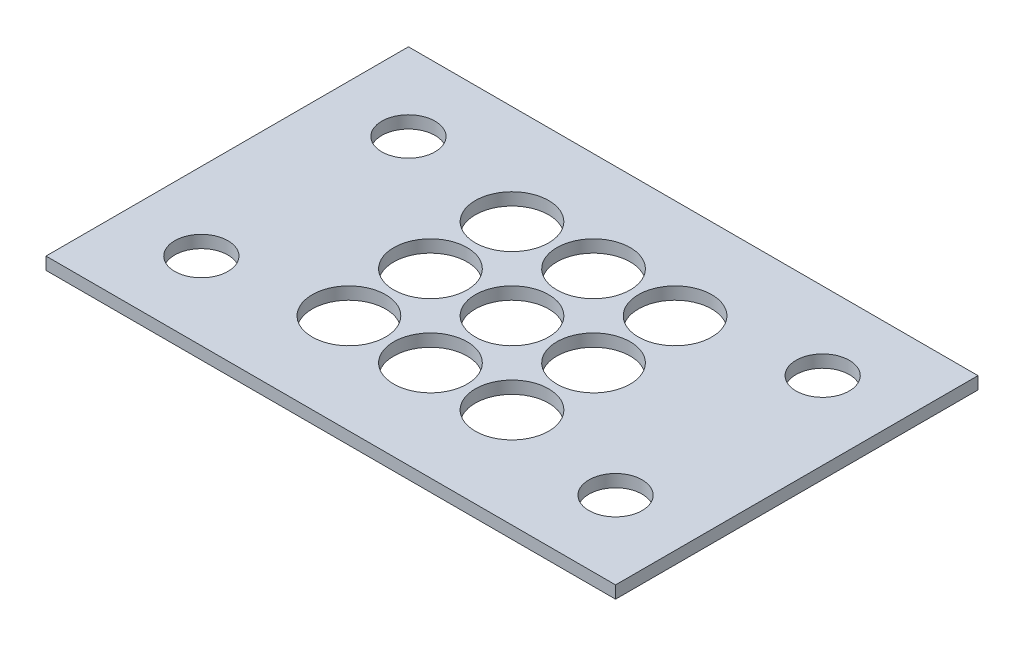
ISO-10303-21;
HEADER;
FILE_DESCRIPTION(('STEP AP214'),'2;1');
FILE_NAME('part.step','',(''),(''),'','','');
FILE_SCHEMA(('AUTOMOTIVE_DESIGN { 1 0 10303 214 1 1 1 1 }'));
ENDSEC;
DATA;
#1=APPLICATION_CONTEXT('core data for automotive mechanical design processes');
#2=APPLICATION_PROTOCOL_DEFINITION('international standard','automotive_design',2000,#1);
#3=PRODUCT_CONTEXT('',#1,'mechanical');
#4=PRODUCT('Part','Part','',(#3));
#5=PRODUCT_RELATED_PRODUCT_CATEGORY('part','',(#4));
#6=PRODUCT_DEFINITION_FORMATION('','',#4);
#7=PRODUCT_DEFINITION_CONTEXT('part definition',#1,'design');
#8=PRODUCT_DEFINITION('design','',#6,#7);
#9=PRODUCT_DEFINITION_SHAPE('','',#8);
#10=(LENGTH_UNIT() NAMED_UNIT(*) SI_UNIT(.MILLI.,.METRE.));
#11=(NAMED_UNIT(*) PLANE_ANGLE_UNIT() SI_UNIT($,.RADIAN.));
#12=(NAMED_UNIT(*) SI_UNIT($,.STERADIAN.) SOLID_ANGLE_UNIT());
#13=UNCERTAINTY_MEASURE_WITH_UNIT(LENGTH_MEASURE(1.E-05),#10,'distance_accuracy_value','');
#14=(GEOMETRIC_REPRESENTATION_CONTEXT(3) GLOBAL_UNCERTAINTY_ASSIGNED_CONTEXT((#13)) GLOBAL_UNIT_ASSIGNED_CONTEXT((#10,
#11,#12)) REPRESENTATION_CONTEXT('',''));
#15=CARTESIAN_POINT('',(0.,0.,0.));
#16=DIRECTION('',(0.,0.,1.));
#17=DIRECTION('',(1.,0.,0.));
#18=AXIS2_PLACEMENT_3D('',#15,#16,#17);
#19=CARTESIAN_POINT('',(0.,1.524,0.));
#20=DIRECTION('',(0.,0.,-1.));
#21=DIRECTION('',(-1.,0.,0.));
#22=AXIS2_PLACEMENT_3D('',#19,#20,#21);
#23=PLANE('',#22);
#24=DIRECTION('',(1.,0.,0.));
#25=VECTOR('',#24,1.);
#26=CARTESIAN_POINT('',(0.,0.,0.));
#27=LINE('',#26,#25);
#28=CARTESIAN_POINT('',(0.,0.,0.));
#29=VERTEX_POINT('',#28);
#30=CARTESIAN_POINT('',(69.85,0.,0.));
#31=VERTEX_POINT('',#30);
#32=EDGE_CURVE('E168',#29,#31,#27,.T.);
#33=ORIENTED_EDGE('',*,*,#32,.T.);
#34=DIRECTION('',(0.,-1.,0.));
#35=VECTOR('',#34,1.);
#36=CARTESIAN_POINT('',(69.85,1.524,0.));
#37=LINE('',#36,#35);
#38=CARTESIAN_POINT('',(69.85,1.524,0.));
#39=VERTEX_POINT('',#38);
#40=EDGE_CURVE('E11',#39,#31,#37,.T.);
#41=ORIENTED_EDGE('',*,*,#40,.F.);
#42=DIRECTION('',(1.,0.,0.));
#43=VECTOR('',#42,1.);
#44=CARTESIAN_POINT('',(0.,1.524,0.));
#45=LINE('',#44,#43);
#46=CARTESIAN_POINT('',(0.,1.524,0.));
#47=VERTEX_POINT('',#46);
#48=EDGE_CURVE('E98',#47,#39,#45,.T.);
#49=ORIENTED_EDGE('',*,*,#48,.F.);
#50=DIRECTION('',(0.,-1.,0.));
#51=VECTOR('',#50,1.);
#52=CARTESIAN_POINT('',(0.,1.524,0.));
#53=LINE('',#52,#51);
#54=EDGE_CURVE('E65',#47,#29,#53,.T.);
#55=ORIENTED_EDGE('',*,*,#54,.T.);
#56=EDGE_LOOP('',(#33,#41,#49,#55));
#57=FACE_BOUND('',#56,.T.);
#58=ADVANCED_FACE('F47',(#57),#23,.F.);
#59=CARTESIAN_POINT('',(69.85,1.524,0.));
#60=DIRECTION('',(-1.,0.,0.));
#61=DIRECTION('',(0.,0.,1.));
#62=AXIS2_PLACEMENT_3D('',#59,#60,#61);
#63=PLANE('',#62);
#64=DIRECTION('',(0.,0.,-1.));
#65=VECTOR('',#64,1.);
#66=CARTESIAN_POINT('',(69.85,0.,0.));
#67=LINE('',#66,#65);
#68=CARTESIAN_POINT('',(69.85,0.,-44.45));
#69=VERTEX_POINT('',#68);
#70=EDGE_CURVE('E104',#31,#69,#67,.T.);
#71=ORIENTED_EDGE('',*,*,#70,.T.);
#72=DIRECTION('',(0.,-1.,0.));
#73=VECTOR('',#72,1.);
#74=CARTESIAN_POINT('',(69.85,1.524,-44.45));
#75=LINE('',#74,#73);
#76=CARTESIAN_POINT('',(69.85,1.524,-44.45));
#77=VERTEX_POINT('',#76);
#78=EDGE_CURVE('E57',#77,#69,#75,.T.);
#79=ORIENTED_EDGE('',*,*,#78,.F.);
#80=DIRECTION('',(0.,0.,-1.));
#81=VECTOR('',#80,1.);
#82=CARTESIAN_POINT('',(69.85,1.524,0.));
#83=LINE('',#82,#81);
#84=EDGE_CURVE('E90',#39,#77,#83,.T.);
#85=ORIENTED_EDGE('',*,*,#84,.F.);
#86=ORIENTED_EDGE('',*,*,#40,.T.);
#87=EDGE_LOOP('',(#71,#79,#85,#86));
#88=FACE_BOUND('',#87,.T.);
#89=ADVANCED_FACE('F103',(#88),#63,.F.);
#90=CARTESIAN_POINT('',(0.,1.524,-44.45));
#91=DIRECTION('',(0.,0.,-1.));
#92=DIRECTION('',(-1.,0.,0.));
#93=AXIS2_PLACEMENT_3D('',#90,#91,#92);
#94=PLANE('',#93);
#95=DIRECTION('',(1.,0.,0.));
#96=VECTOR('',#95,1.);
#97=CARTESIAN_POINT('',(0.,0.,-44.45));
#98=LINE('',#97,#96);
#99=CARTESIAN_POINT('',(0.,0.,-44.45));
#100=VERTEX_POINT('',#99);
#101=EDGE_CURVE('E173',#100,#69,#98,.T.);
#102=ORIENTED_EDGE('',*,*,#101,.F.);
#103=DIRECTION('',(0.,-1.,0.));
#104=VECTOR('',#103,1.);
#105=CARTESIAN_POINT('',(0.,1.524,-44.45));
#106=LINE('',#105,#104);
#107=CARTESIAN_POINT('',(0.,1.524,-44.45));
#108=VERTEX_POINT('',#107);
#109=EDGE_CURVE('E79',#108,#100,#106,.T.);
#110=ORIENTED_EDGE('',*,*,#109,.F.);
#111=DIRECTION('',(1.,0.,0.));
#112=VECTOR('',#111,1.);
#113=CARTESIAN_POINT('',(0.,1.524,-44.45));
#114=LINE('',#113,#112);
#115=EDGE_CURVE('E97',#108,#77,#114,.T.);
#116=ORIENTED_EDGE('',*,*,#115,.T.);
#117=ORIENTED_EDGE('',*,*,#78,.T.);
#118=EDGE_LOOP('',(#102,#110,#116,#117));
#119=FACE_BOUND('',#118,.T.);
#120=ADVANCED_FACE('F108',(#119),#94,.T.);
#121=CARTESIAN_POINT('',(9.525,1.524,-34.925));
#122=DIRECTION('',(0.,-1.,0.));
#123=DIRECTION('',(0.,0.,-1.));
#124=AXIS2_PLACEMENT_3D('',#121,#122,#123);
#125=CYLINDRICAL_SURFACE('',#124,3.2639);
#126=CARTESIAN_POINT('',(9.525,1.524,-34.925));
#127=DIRECTION('',(0.,1.,0.));
#128=DIRECTION('',(0.,0.,1.));
#129=AXIS2_PLACEMENT_3D('',#126,#127,#128);
#130=CIRCLE('',#129,3.2639);
#131=CARTESIAN_POINT('',(9.525,1.524,-31.6611));
#132=VERTEX_POINT('',#131);
#133=EDGE_CURVE('E235',#132,#132,#130,.T.);
#134=ORIENTED_EDGE('',*,*,#133,.T.);
#135=EDGE_LOOP('',(#134));
#136=FACE_BOUND('',#135,.T.);
#137=CARTESIAN_POINT('',(9.525,0.,-34.925));
#138=DIRECTION('',(0.,1.,0.));
#139=DIRECTION('',(0.,0.,1.));
#140=AXIS2_PLACEMENT_3D('',#137,#138,#139);
#141=CIRCLE('',#140,3.2639);
#142=CARTESIAN_POINT('',(9.525,0.,-31.6611));
#143=VERTEX_POINT('',#142);
#144=EDGE_CURVE('E164',#143,#143,#141,.T.);
#145=ORIENTED_EDGE('',*,*,#144,.F.);
#146=EDGE_LOOP('',(#145));
#147=FACE_BOUND('',#146,.T.);
#148=ADVANCED_FACE('F241',(#136,#147),#125,.F.);
#149=CARTESIAN_POINT('',(60.325,1.524,-34.925));
#150=DIRECTION('',(0.,-1.,0.));
#151=DIRECTION('',(0.,0.,-1.));
#152=AXIS2_PLACEMENT_3D('',#149,#150,#151);
#153=CYLINDRICAL_SURFACE('',#152,3.2639);
#154=CARTESIAN_POINT('',(60.325,1.524,-34.925));
#155=DIRECTION('',(0.,1.,0.));
#156=DIRECTION('',(0.,0.,1.));
#157=AXIS2_PLACEMENT_3D('',#154,#155,#156);
#158=CIRCLE('',#157,3.2639);
#159=CARTESIAN_POINT('',(60.325,1.524,-31.6611));
#160=VERTEX_POINT('',#159);
#161=EDGE_CURVE('E231',#160,#160,#158,.T.);
#162=ORIENTED_EDGE('',*,*,#161,.T.);
#163=EDGE_LOOP('',(#162));
#164=FACE_BOUND('',#163,.T.);
#165=CARTESIAN_POINT('',(60.325,0.,-34.925));
#166=DIRECTION('',(0.,1.,0.));
#167=DIRECTION('',(0.,0.,1.));
#168=AXIS2_PLACEMENT_3D('',#165,#166,#167);
#169=CIRCLE('',#168,3.2639);
#170=CARTESIAN_POINT('',(60.325,0.,-31.6611));
#171=VERTEX_POINT('',#170);
#172=EDGE_CURVE('E160',#171,#171,#169,.T.);
#173=ORIENTED_EDGE('',*,*,#172,.F.);
#174=EDGE_LOOP('',(#173));
#175=FACE_BOUND('',#174,.T.);
#176=ADVANCED_FACE('F267',(#164,#175),#153,.F.);
#177=CARTESIAN_POINT('',(9.52500000000001,1.524,-9.525));
#178=DIRECTION('',(0.,-1.,0.));
#179=DIRECTION('',(0.,0.,-1.));
#180=AXIS2_PLACEMENT_3D('',#177,#178,#179);
#181=CYLINDRICAL_SURFACE('',#180,3.2639);
#182=CARTESIAN_POINT('',(9.52500000000001,1.524,-9.525));
#183=DIRECTION('',(0.,1.,0.));
#184=DIRECTION('',(0.,0.,1.));
#185=AXIS2_PLACEMENT_3D('',#182,#183,#184);
#186=CIRCLE('',#185,3.2639);
#187=CARTESIAN_POINT('',(9.52500000000001,1.524,-6.2611));
#188=VERTEX_POINT('',#187);
#189=EDGE_CURVE('E227',#188,#188,#186,.T.);
#190=ORIENTED_EDGE('',*,*,#189,.T.);
#191=EDGE_LOOP('',(#190));
#192=FACE_BOUND('',#191,.T.);
#193=CARTESIAN_POINT('',(9.52500000000001,0.,-9.525));
#194=DIRECTION('',(0.,1.,0.));
#195=DIRECTION('',(0.,0.,1.));
#196=AXIS2_PLACEMENT_3D('',#193,#194,#195);
#197=CIRCLE('',#196,3.2639);
#198=CARTESIAN_POINT('',(9.52500000000001,0.,-6.2611));
#199=VERTEX_POINT('',#198);
#200=EDGE_CURVE('E156',#199,#199,#197,.T.);
#201=ORIENTED_EDGE('',*,*,#200,.F.);
#202=EDGE_LOOP('',(#201));
#203=FACE_BOUND('',#202,.T.);
#204=ADVANCED_FACE('F270',(#192,#203),#181,.F.);
#205=CARTESIAN_POINT('',(60.325,1.524,-9.525));
#206=DIRECTION('',(0.,-1.,0.));
#207=DIRECTION('',(0.,0.,-1.));
#208=AXIS2_PLACEMENT_3D('',#205,#206,#207);
#209=CYLINDRICAL_SURFACE('',#208,3.26389999999999);
#210=CARTESIAN_POINT('',(60.325,1.524,-9.525));
#211=DIRECTION('',(0.,1.,0.));
#212=DIRECTION('',(0.,0.,1.));
#213=AXIS2_PLACEMENT_3D('',#210,#211,#212);
#214=CIRCLE('',#213,3.26389999999999);
#215=CARTESIAN_POINT('',(60.325,1.524,-6.2611));
#216=VERTEX_POINT('',#215);
#217=EDGE_CURVE('E223',#216,#216,#214,.T.);
#218=ORIENTED_EDGE('',*,*,#217,.T.);
#219=EDGE_LOOP('',(#218));
#220=FACE_BOUND('',#219,.T.);
#221=CARTESIAN_POINT('',(60.325,0.,-9.525));
#222=DIRECTION('',(0.,1.,0.));
#223=DIRECTION('',(0.,0.,1.));
#224=AXIS2_PLACEMENT_3D('',#221,#222,#223);
#225=CIRCLE('',#224,3.26389999999999);
#226=CARTESIAN_POINT('',(60.325,0.,-6.2611));
#227=VERTEX_POINT('',#226);
#228=EDGE_CURVE('E152',#227,#227,#225,.T.);
#229=ORIENTED_EDGE('',*,*,#228,.F.);
#230=EDGE_LOOP('',(#229));
#231=FACE_BOUND('',#230,.T.);
#232=ADVANCED_FACE('F274',(#220,#231),#209,.F.);
#233=CARTESIAN_POINT('',(34.925,1.524,-22.225));
#234=DIRECTION('',(0.,-1.,0.));
#235=DIRECTION('',(0.,0.,-1.));
#236=AXIS2_PLACEMENT_3D('',#233,#234,#235);
#237=CYLINDRICAL_SURFACE('',#236,4.5);
#238=CARTESIAN_POINT('',(34.925,1.524,-22.225));
#239=DIRECTION('',(0.,1.,0.));
#240=DIRECTION('',(0.,0.,1.));
#241=AXIS2_PLACEMENT_3D('',#238,#239,#240);
#242=CIRCLE('',#241,4.5);
#243=CARTESIAN_POINT('',(34.925,1.524,-17.725));
#244=VERTEX_POINT('',#243);
#245=EDGE_CURVE('E219',#244,#244,#242,.T.);
#246=ORIENTED_EDGE('',*,*,#245,.T.);
#247=EDGE_LOOP('',(#246));
#248=FACE_BOUND('',#247,.T.);
#249=CARTESIAN_POINT('',(34.925,0.,-22.225));
#250=DIRECTION('',(0.,1.,0.));
#251=DIRECTION('',(0.,0.,1.));
#252=AXIS2_PLACEMENT_3D('',#249,#250,#251);
#253=CIRCLE('',#252,4.5);
#254=CARTESIAN_POINT('',(34.925,0.,-17.725));
#255=VERTEX_POINT('',#254);
#256=EDGE_CURVE('E148',#255,#255,#253,.T.);
#257=ORIENTED_EDGE('',*,*,#256,.F.);
#258=EDGE_LOOP('',(#257));
#259=FACE_BOUND('',#258,.T.);
#260=ADVANCED_FACE('F278',(#248,#259),#237,.F.);
#261=CARTESIAN_POINT('',(44.925,1.524,-22.225));
#262=DIRECTION('',(0.,-1.,0.));
#263=DIRECTION('',(0.,0.,-1.));
#264=AXIS2_PLACEMENT_3D('',#261,#262,#263);
#265=CYLINDRICAL_SURFACE('',#264,4.5);
#266=CARTESIAN_POINT('',(44.925,1.524,-22.225));
#267=DIRECTION('',(0.,1.,0.));
#268=DIRECTION('',(0.,0.,1.));
#269=AXIS2_PLACEMENT_3D('',#266,#267,#268);
#270=CIRCLE('',#269,4.5);
#271=CARTESIAN_POINT('',(44.925,1.524,-17.725));
#272=VERTEX_POINT('',#271);
#273=EDGE_CURVE('E215',#272,#272,#270,.T.);
#274=ORIENTED_EDGE('',*,*,#273,.T.);
#275=EDGE_LOOP('',(#274));
#276=FACE_BOUND('',#275,.T.);
#277=CARTESIAN_POINT('',(44.925,0.,-22.225));
#278=DIRECTION('',(0.,1.,0.));
#279=DIRECTION('',(0.,0.,1.));
#280=AXIS2_PLACEMENT_3D('',#277,#278,#279);
#281=CIRCLE('',#280,4.5);
#282=CARTESIAN_POINT('',(44.925,0.,-17.725));
#283=VERTEX_POINT('',#282);
#284=EDGE_CURVE('E144',#283,#283,#281,.T.);
#285=ORIENTED_EDGE('',*,*,#284,.F.);
#286=EDGE_LOOP('',(#285));
#287=FACE_BOUND('',#286,.T.);
#288=ADVANCED_FACE('F282',(#276,#287),#265,.F.);
#289=CARTESIAN_POINT('',(44.925,1.524,-32.225));
#290=DIRECTION('',(0.,-1.,0.));
#291=DIRECTION('',(0.,0.,-1.));
#292=AXIS2_PLACEMENT_3D('',#289,#290,#291);
#293=CYLINDRICAL_SURFACE('',#292,4.5);
#294=CARTESIAN_POINT('',(44.925,1.524,-32.225));
#295=DIRECTION('',(0.,1.,0.));
#296=DIRECTION('',(0.,0.,1.));
#297=AXIS2_PLACEMENT_3D('',#294,#295,#296);
#298=CIRCLE('',#297,4.5);
#299=CARTESIAN_POINT('',(44.925,1.524,-27.725));
#300=VERTEX_POINT('',#299);
#301=EDGE_CURVE('E211',#300,#300,#298,.T.);
#302=ORIENTED_EDGE('',*,*,#301,.T.);
#303=EDGE_LOOP('',(#302));
#304=FACE_BOUND('',#303,.T.);
#305=CARTESIAN_POINT('',(44.925,0.,-32.225));
#306=DIRECTION('',(0.,1.,0.));
#307=DIRECTION('',(0.,0.,1.));
#308=AXIS2_PLACEMENT_3D('',#305,#306,#307);
#309=CIRCLE('',#308,4.5);
#310=CARTESIAN_POINT('',(44.925,0.,-27.725));
#311=VERTEX_POINT('',#310);
#312=EDGE_CURVE('E140',#311,#311,#309,.T.);
#313=ORIENTED_EDGE('',*,*,#312,.F.);
#314=EDGE_LOOP('',(#313));
#315=FACE_BOUND('',#314,.T.);
#316=ADVANCED_FACE('F286',(#304,#315),#293,.F.);
#317=CARTESIAN_POINT('',(34.925,1.524,-32.225));
#318=DIRECTION('',(0.,-1.,0.));
#319=DIRECTION('',(0.,0.,-1.));
#320=AXIS2_PLACEMENT_3D('',#317,#318,#319);
#321=CYLINDRICAL_SURFACE('',#320,4.5);
#322=CARTESIAN_POINT('',(34.925,1.524,-32.225));
#323=DIRECTION('',(0.,1.,0.));
#324=DIRECTION('',(0.,0.,1.));
#325=AXIS2_PLACEMENT_3D('',#322,#323,#324);
#326=CIRCLE('',#325,4.5);
#327=CARTESIAN_POINT('',(34.925,1.524,-27.725));
#328=VERTEX_POINT('',#327);
#329=EDGE_CURVE('E207',#328,#328,#326,.T.);
#330=ORIENTED_EDGE('',*,*,#329,.T.);
#331=EDGE_LOOP('',(#330));
#332=FACE_BOUND('',#331,.T.);
#333=CARTESIAN_POINT('',(34.925,0.,-32.225));
#334=DIRECTION('',(0.,1.,0.));
#335=DIRECTION('',(0.,0.,1.));
#336=AXIS2_PLACEMENT_3D('',#333,#334,#335);
#337=CIRCLE('',#336,4.5);
#338=CARTESIAN_POINT('',(34.925,0.,-27.725));
#339=VERTEX_POINT('',#338);
#340=EDGE_CURVE('E136',#339,#339,#337,.T.);
#341=ORIENTED_EDGE('',*,*,#340,.F.);
#342=EDGE_LOOP('',(#341));
#343=FACE_BOUND('',#342,.T.);
#344=ADVANCED_FACE('F290',(#332,#343),#321,.F.);
#345=CARTESIAN_POINT('',(44.9250000000001,1.524,-12.225));
#346=DIRECTION('',(0.,-1.,0.));
#347=DIRECTION('',(0.,0.,-1.));
#348=AXIS2_PLACEMENT_3D('',#345,#346,#347);
#349=CYLINDRICAL_SURFACE('',#348,4.5);
#350=CARTESIAN_POINT('',(44.9250000000001,1.524,-12.225));
#351=DIRECTION('',(0.,1.,0.));
#352=DIRECTION('',(0.,0.,1.));
#353=AXIS2_PLACEMENT_3D('',#350,#351,#352);
#354=CIRCLE('',#353,4.5);
#355=CARTESIAN_POINT('',(44.9250000000001,1.524,-7.725));
#356=VERTEX_POINT('',#355);
#357=EDGE_CURVE('E203',#356,#356,#354,.T.);
#358=ORIENTED_EDGE('',*,*,#357,.T.);
#359=EDGE_LOOP('',(#358));
#360=FACE_BOUND('',#359,.T.);
#361=CARTESIAN_POINT('',(44.9250000000001,0.,-12.225));
#362=DIRECTION('',(0.,1.,0.));
#363=DIRECTION('',(0.,0.,1.));
#364=AXIS2_PLACEMENT_3D('',#361,#362,#363);
#365=CIRCLE('',#364,4.5);
#366=CARTESIAN_POINT('',(44.9250000000001,0.,-7.725));
#367=VERTEX_POINT('',#366);
#368=EDGE_CURVE('E132',#367,#367,#365,.T.);
#369=ORIENTED_EDGE('',*,*,#368,.F.);
#370=EDGE_LOOP('',(#369));
#371=FACE_BOUND('',#370,.T.);
#372=ADVANCED_FACE('F294',(#360,#371),#349,.F.);
#373=CARTESIAN_POINT('',(34.9250000000001,1.524,-12.225));
#374=DIRECTION('',(0.,-1.,0.));
#375=DIRECTION('',(0.,0.,-1.));
#376=AXIS2_PLACEMENT_3D('',#373,#374,#375);
#377=CYLINDRICAL_SURFACE('',#376,4.5);
#378=CARTESIAN_POINT('',(34.9250000000001,1.524,-12.225));
#379=DIRECTION('',(0.,1.,0.));
#380=DIRECTION('',(0.,0.,1.));
#381=AXIS2_PLACEMENT_3D('',#378,#379,#380);
#382=CIRCLE('',#381,4.5);
#383=CARTESIAN_POINT('',(34.9250000000001,1.524,-7.725));
#384=VERTEX_POINT('',#383);
#385=EDGE_CURVE('E199',#384,#384,#382,.T.);
#386=ORIENTED_EDGE('',*,*,#385,.T.);
#387=EDGE_LOOP('',(#386));
#388=FACE_BOUND('',#387,.T.);
#389=CARTESIAN_POINT('',(34.9250000000001,0.,-12.225));
#390=DIRECTION('',(0.,1.,0.));
#391=DIRECTION('',(0.,0.,1.));
#392=AXIS2_PLACEMENT_3D('',#389,#390,#391);
#393=CIRCLE('',#392,4.5);
#394=CARTESIAN_POINT('',(34.9250000000001,0.,-7.725));
#395=VERTEX_POINT('',#394);
#396=EDGE_CURVE('E128',#395,#395,#393,.T.);
#397=ORIENTED_EDGE('',*,*,#396,.F.);
#398=EDGE_LOOP('',(#397));
#399=FACE_BOUND('',#398,.T.);
#400=ADVANCED_FACE('F298',(#388,#399),#377,.F.);
#401=CARTESIAN_POINT('',(24.925,1.524,-22.2249999999999));
#402=DIRECTION('',(0.,-1.,0.));
#403=DIRECTION('',(0.,0.,-1.));
#404=AXIS2_PLACEMENT_3D('',#401,#402,#403);
#405=CYLINDRICAL_SURFACE('',#404,4.5);
#406=CARTESIAN_POINT('',(24.925,1.524,-22.2249999999999));
#407=DIRECTION('',(0.,1.,0.));
#408=DIRECTION('',(0.,0.,1.));
#409=AXIS2_PLACEMENT_3D('',#406,#407,#408);
#410=CIRCLE('',#409,4.5);
#411=CARTESIAN_POINT('',(24.925,1.524,-17.7249999999999));
#412=VERTEX_POINT('',#411);
#413=EDGE_CURVE('E193',#412,#412,#410,.T.);
#414=ORIENTED_EDGE('',*,*,#413,.T.);
#415=EDGE_LOOP('',(#414));
#416=FACE_BOUND('',#415,.T.);
#417=CARTESIAN_POINT('',(24.925,0.,-22.2249999999999));
#418=DIRECTION('',(0.,1.,0.));
#419=DIRECTION('',(0.,0.,1.));
#420=AXIS2_PLACEMENT_3D('',#417,#418,#419);
#421=CIRCLE('',#420,4.5);
#422=CARTESIAN_POINT('',(24.925,0.,-17.7249999999999));
#423=VERTEX_POINT('',#422);
#424=EDGE_CURVE('E124',#423,#423,#421,.T.);
#425=ORIENTED_EDGE('',*,*,#424,.F.);
#426=EDGE_LOOP('',(#425));
#427=FACE_BOUND('',#426,.T.);
#428=ADVANCED_FACE('F302',(#416,#427),#405,.F.);
#429=CARTESIAN_POINT('',(24.925,1.524,-32.225));
#430=DIRECTION('',(0.,-1.,0.));
#431=DIRECTION('',(0.,0.,-1.));
#432=AXIS2_PLACEMENT_3D('',#429,#430,#431);
#433=CYLINDRICAL_SURFACE('',#432,4.5);
#434=CARTESIAN_POINT('',(24.925,1.524,-32.225));
#435=DIRECTION('',(0.,1.,0.));
#436=DIRECTION('',(0.,0.,1.));
#437=AXIS2_PLACEMENT_3D('',#434,#435,#436);
#438=CIRCLE('',#437,4.5);
#439=CARTESIAN_POINT('',(24.925,1.524,-27.725));
#440=VERTEX_POINT('',#439);
#441=EDGE_CURVE('E187',#440,#440,#438,.T.);
#442=ORIENTED_EDGE('',*,*,#441,.T.);
#443=EDGE_LOOP('',(#442));
#444=FACE_BOUND('',#443,.T.);
#445=CARTESIAN_POINT('',(24.925,0.,-32.225));
#446=DIRECTION('',(0.,1.,0.));
#447=DIRECTION('',(0.,0.,1.));
#448=AXIS2_PLACEMENT_3D('',#445,#446,#447);
#449=CIRCLE('',#448,4.5);
#450=CARTESIAN_POINT('',(24.925,0.,-27.725));
#451=VERTEX_POINT('',#450);
#452=EDGE_CURVE('E120',#451,#451,#449,.T.);
#453=ORIENTED_EDGE('',*,*,#452,.F.);
#454=EDGE_LOOP('',(#453));
#455=FACE_BOUND('',#454,.T.);
#456=ADVANCED_FACE('F305',(#444,#455),#433,.F.);
#457=CARTESIAN_POINT('',(24.9250000000001,1.524,-12.2249999999999));
#458=DIRECTION('',(0.,-1.,0.));
#459=DIRECTION('',(0.,0.,-1.));
#460=AXIS2_PLACEMENT_3D('',#457,#458,#459);
#461=CYLINDRICAL_SURFACE('',#460,4.5);
#462=CARTESIAN_POINT('',(24.9250000000001,1.524,-12.2249999999999));
#463=DIRECTION('',(0.,1.,0.));
#464=DIRECTION('',(0.,0.,1.));
#465=AXIS2_PLACEMENT_3D('',#462,#463,#464);
#466=CIRCLE('',#465,4.5);
#467=CARTESIAN_POINT('',(24.9250000000001,1.524,-7.72499999999993));
#468=VERTEX_POINT('',#467);
#469=EDGE_CURVE('E180',#468,#468,#466,.T.);
#470=ORIENTED_EDGE('',*,*,#469,.T.);
#471=EDGE_LOOP('',(#470));
#472=FACE_BOUND('',#471,.T.);
#473=CARTESIAN_POINT('',(24.9250000000001,0.,-12.2249999999999));
#474=DIRECTION('',(0.,1.,0.));
#475=DIRECTION('',(0.,0.,1.));
#476=AXIS2_PLACEMENT_3D('',#473,#474,#475);
#477=CIRCLE('',#476,4.5);
#478=CARTESIAN_POINT('',(24.9250000000001,0.,-7.72499999999993));
#479=VERTEX_POINT('',#478);
#480=EDGE_CURVE('E116',#479,#479,#477,.T.);
#481=ORIENTED_EDGE('',*,*,#480,.F.);
#482=EDGE_LOOP('',(#481));
#483=FACE_BOUND('',#482,.T.);
#484=ADVANCED_FACE('F49',(#472,#483),#461,.F.);
#485=CARTESIAN_POINT('',(0.,1.524,0.));
#486=DIRECTION('',(-1.,0.,0.));
#487=DIRECTION('',(0.,0.,1.));
#488=AXIS2_PLACEMENT_3D('',#485,#486,#487);
#489=PLANE('',#488);
#490=DIRECTION('',(0.,0.,-1.));
#491=VECTOR('',#490,1.);
#492=CARTESIAN_POINT('',(0.,0.,0.));
#493=LINE('',#492,#491);
#494=EDGE_CURVE('E176',#29,#100,#493,.T.);
#495=ORIENTED_EDGE('',*,*,#494,.F.);
#496=ORIENTED_EDGE('',*,*,#54,.F.);
#497=DIRECTION('',(0.,0.,-1.));
#498=VECTOR('',#497,1.);
#499=CARTESIAN_POINT('',(0.,1.524,0.));
#500=LINE('',#499,#498);
#501=EDGE_CURVE('E110',#47,#108,#500,.T.);
#502=ORIENTED_EDGE('',*,*,#501,.T.);
#503=ORIENTED_EDGE('',*,*,#109,.T.);
#504=EDGE_LOOP('',(#495,#496,#502,#503));
#505=FACE_BOUND('',#504,.T.);
#506=ADVANCED_FACE('F246',(#505),#489,.T.);
#507=CARTESIAN_POINT('',(0.,1.524,0.));
#508=DIRECTION('',(0.,1.,0.));
#509=DIRECTION('',(0.,0.,1.));
#510=AXIS2_PLACEMENT_3D('',#507,#508,#509);
#511=PLANE('',#510);
#512=ORIENTED_EDGE('',*,*,#469,.F.);
#513=EDGE_LOOP('',(#512));
#514=FACE_BOUND('',#513,.T.);
#515=ORIENTED_EDGE('',*,*,#441,.F.);
#516=EDGE_LOOP('',(#515));
#517=FACE_BOUND('',#516,.T.);
#518=ORIENTED_EDGE('',*,*,#413,.F.);
#519=EDGE_LOOP('',(#518));
#520=FACE_BOUND('',#519,.T.);
#521=ORIENTED_EDGE('',*,*,#385,.F.);
#522=EDGE_LOOP('',(#521));
#523=FACE_BOUND('',#522,.T.);
#524=ORIENTED_EDGE('',*,*,#357,.F.);
#525=EDGE_LOOP('',(#524));
#526=FACE_BOUND('',#525,.T.);
#527=ORIENTED_EDGE('',*,*,#329,.F.);
#528=EDGE_LOOP('',(#527));
#529=FACE_BOUND('',#528,.T.);
#530=ORIENTED_EDGE('',*,*,#301,.F.);
#531=EDGE_LOOP('',(#530));
#532=FACE_BOUND('',#531,.T.);
#533=ORIENTED_EDGE('',*,*,#273,.F.);
#534=EDGE_LOOP('',(#533));
#535=FACE_BOUND('',#534,.T.);
#536=ORIENTED_EDGE('',*,*,#245,.F.);
#537=EDGE_LOOP('',(#536));
#538=FACE_BOUND('',#537,.T.);
#539=ORIENTED_EDGE('',*,*,#217,.F.);
#540=EDGE_LOOP('',(#539));
#541=FACE_BOUND('',#540,.T.);
#542=ORIENTED_EDGE('',*,*,#189,.F.);
#543=EDGE_LOOP('',(#542));
#544=FACE_BOUND('',#543,.T.);
#545=ORIENTED_EDGE('',*,*,#161,.F.);
#546=EDGE_LOOP('',(#545));
#547=FACE_BOUND('',#546,.T.);
#548=ORIENTED_EDGE('',*,*,#133,.F.);
#549=EDGE_LOOP('',(#548));
#550=FACE_BOUND('',#549,.T.);
#551=ORIENTED_EDGE('',*,*,#48,.T.);
#552=ORIENTED_EDGE('',*,*,#84,.T.);
#553=ORIENTED_EDGE('',*,*,#115,.F.);
#554=ORIENTED_EDGE('',*,*,#501,.F.);
#555=EDGE_LOOP('',(#551,#552,#553,#554));
#556=FACE_BOUND('',#555,.T.);
#557=ADVANCED_FACE('F94',(#514,#517,#520,#523,#526,#529,#532,#535,#538,#541,#544,#547,#550,
#556),#511,.T.);
#558=CARTESIAN_POINT('',(0.,0.,0.));
#559=DIRECTION('',(0.,1.,0.));
#560=DIRECTION('',(0.,0.,1.));
#561=AXIS2_PLACEMENT_3D('',#558,#559,#560);
#562=PLANE('',#561);
#563=ORIENTED_EDGE('',*,*,#480,.T.);
#564=EDGE_LOOP('',(#563));
#565=FACE_BOUND('',#564,.T.);
#566=ORIENTED_EDGE('',*,*,#452,.T.);
#567=EDGE_LOOP('',(#566));
#568=FACE_BOUND('',#567,.T.);
#569=ORIENTED_EDGE('',*,*,#424,.T.);
#570=EDGE_LOOP('',(#569));
#571=FACE_BOUND('',#570,.T.);
#572=ORIENTED_EDGE('',*,*,#396,.T.);
#573=EDGE_LOOP('',(#572));
#574=FACE_BOUND('',#573,.T.);
#575=ORIENTED_EDGE('',*,*,#368,.T.);
#576=EDGE_LOOP('',(#575));
#577=FACE_BOUND('',#576,.T.);
#578=ORIENTED_EDGE('',*,*,#340,.T.);
#579=EDGE_LOOP('',(#578));
#580=FACE_BOUND('',#579,.T.);
#581=ORIENTED_EDGE('',*,*,#312,.T.);
#582=EDGE_LOOP('',(#581));
#583=FACE_BOUND('',#582,.T.);
#584=ORIENTED_EDGE('',*,*,#284,.T.);
#585=EDGE_LOOP('',(#584));
#586=FACE_BOUND('',#585,.T.);
#587=ORIENTED_EDGE('',*,*,#256,.T.);
#588=EDGE_LOOP('',(#587));
#589=FACE_BOUND('',#588,.T.);
#590=ORIENTED_EDGE('',*,*,#228,.T.);
#591=EDGE_LOOP('',(#590));
#592=FACE_BOUND('',#591,.T.);
#593=ORIENTED_EDGE('',*,*,#200,.T.);
#594=EDGE_LOOP('',(#593));
#595=FACE_BOUND('',#594,.T.);
#596=ORIENTED_EDGE('',*,*,#172,.T.);
#597=EDGE_LOOP('',(#596));
#598=FACE_BOUND('',#597,.T.);
#599=ORIENTED_EDGE('',*,*,#144,.T.);
#600=EDGE_LOOP('',(#599));
#601=FACE_BOUND('',#600,.T.);
#602=ORIENTED_EDGE('',*,*,#32,.F.);
#603=ORIENTED_EDGE('',*,*,#494,.T.);
#604=ORIENTED_EDGE('',*,*,#101,.T.);
#605=ORIENTED_EDGE('',*,*,#70,.F.);
#606=EDGE_LOOP('',(#602,#603,#604,#605));
#607=FACE_BOUND('',#606,.T.);
#608=ADVANCED_FACE('F245',(#565,#568,#571,#574,#577,#580,#583,#586,#589,#592,#595,#598,#601,
#607),#562,.F.);
#609=CLOSED_SHELL('',(#58,#89,#120,#148,#176,#204,#232,#260,#288,#316,#344,#372,#400,#428,#456,
#484,#506,#557,#608));
#610=MANIFOLD_SOLID_BREP('B2',#609);
#611=ADVANCED_BREP_SHAPE_REPRESENTATION('',(#18,#610),#14);
#612=SHAPE_DEFINITION_REPRESENTATION(#9,#611);
ENDSEC;
END-ISO-10303-21;
